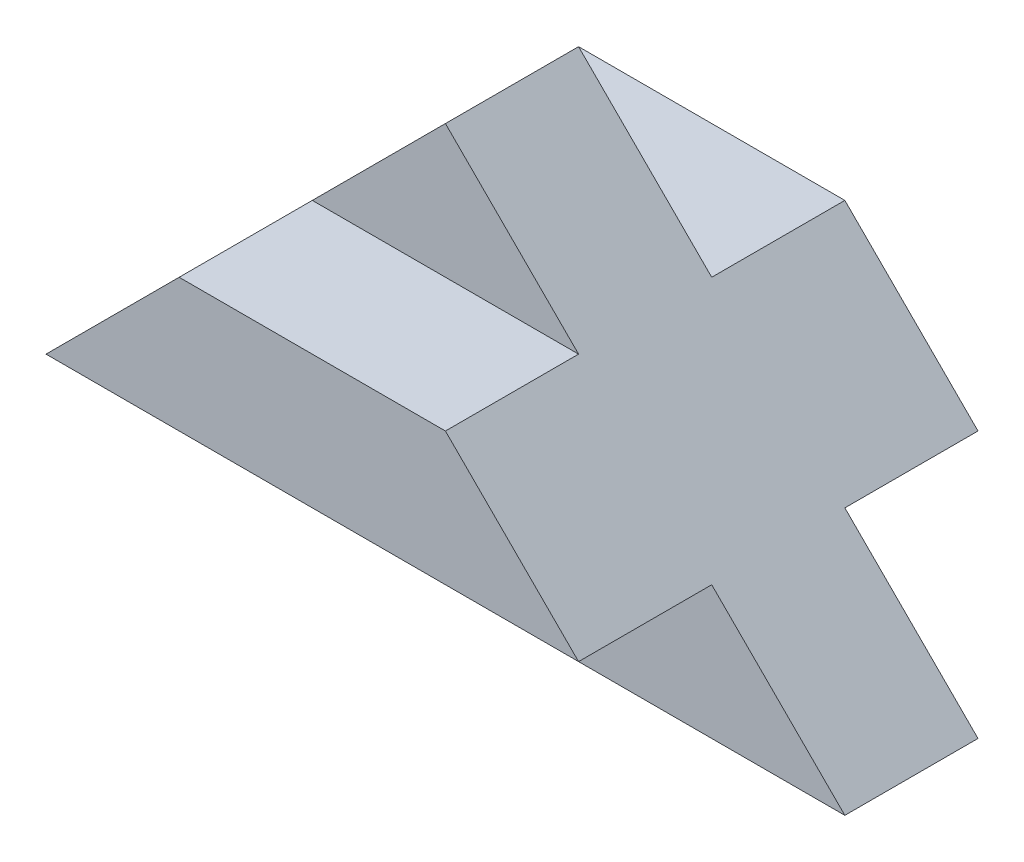
ISO-10303-21;
HEADER;
FILE_DESCRIPTION(('STEP AP214'),'2;1');
FILE_NAME('part.step','',(''),(''),'','','');
FILE_SCHEMA(('AUTOMOTIVE_DESIGN { 1 0 10303 214 1 1 1 1 }'));
ENDSEC;
DATA;
#1=APPLICATION_CONTEXT('core data for automotive mechanical design processes');
#2=APPLICATION_PROTOCOL_DEFINITION('international standard','automotive_design',2000,#1);
#3=PRODUCT_CONTEXT('',#1,'mechanical');
#4=PRODUCT('Part','Part','',(#3));
#5=PRODUCT_RELATED_PRODUCT_CATEGORY('part','',(#4));
#6=PRODUCT_DEFINITION_FORMATION('','',#4);
#7=PRODUCT_DEFINITION_CONTEXT('part definition',#1,'design');
#8=PRODUCT_DEFINITION('design','',#6,#7);
#9=PRODUCT_DEFINITION_SHAPE('','',#8);
#10=(LENGTH_UNIT() NAMED_UNIT(*) SI_UNIT(.MILLI.,.METRE.));
#11=(NAMED_UNIT(*) PLANE_ANGLE_UNIT() SI_UNIT($,.RADIAN.));
#12=(NAMED_UNIT(*) SI_UNIT($,.STERADIAN.) SOLID_ANGLE_UNIT());
#13=UNCERTAINTY_MEASURE_WITH_UNIT(LENGTH_MEASURE(1.E-05),#10,'distance_accuracy_value','');
#14=(GEOMETRIC_REPRESENTATION_CONTEXT(3) GLOBAL_UNCERTAINTY_ASSIGNED_CONTEXT((#13)) GLOBAL_UNIT_ASSIGNED_CONTEXT((#10,
#11,#12)) REPRESENTATION_CONTEXT('',''));
#15=CARTESIAN_POINT('',(0.,0.,0.));
#16=DIRECTION('',(0.,0.,1.));
#17=DIRECTION('',(1.,0.,0.));
#18=AXIS2_PLACEMENT_3D('',#15,#16,#17);
#19=CARTESIAN_POINT('',(304.8,50.8,76.2));
#20=DIRECTION('',(0.,1.,0.));
#21=DIRECTION('',(0.,0.,1.));
#22=AXIS2_PLACEMENT_3D('',#19,#20,#21);
#23=PLANE('',#22);
#24=DIRECTION('',(-1.,0.,0.));
#25=VECTOR('',#24,1.);
#26=CARTESIAN_POINT('',(304.8,50.8,-76.2));
#27=LINE('',#26,#25);
#28=CARTESIAN_POINT('',(254.,50.8,-76.2));
#29=VERTEX_POINT('',#28);
#30=CARTESIAN_POINT('',(50.8000000000002,50.8,-76.2));
#31=VERTEX_POINT('',#30);
#32=EDGE_CURVE('E168',#29,#31,#27,.T.);
#33=ORIENTED_EDGE('',*,*,#32,.F.);
#34=DIRECTION('',(0.,0.,1.));
#35=VECTOR('',#34,1.);
#36=CARTESIAN_POINT('',(254.,50.8,25.4));
#37=LINE('',#36,#35);
#38=CARTESIAN_POINT('',(254.,50.8,-25.4));
#39=VERTEX_POINT('',#38);
#40=EDGE_CURVE('E195',#29,#39,#37,.T.);
#41=ORIENTED_EDGE('',*,*,#40,.T.);
#42=DIRECTION('',(-1.,0.,0.));
#43=VECTOR('',#42,1.);
#44=CARTESIAN_POINT('',(304.8,50.8,-25.4));
#45=LINE('',#44,#43);
#46=CARTESIAN_POINT('',(50.8000000000001,50.8,-25.4));
#47=VERTEX_POINT('',#46);
#48=EDGE_CURVE('E175',#39,#47,#45,.T.);
#49=ORIENTED_EDGE('',*,*,#48,.T.);
#50=DIRECTION('',(0.,0.,1.));
#51=VECTOR('',#50,1.);
#52=CARTESIAN_POINT('',(50.8000000000001,50.8,0.));
#53=LINE('',#52,#51);
#54=EDGE_CURVE('E193',#47,#31,#53,.F.);
#55=ORIENTED_EDGE('',*,*,#54,.T.);
#56=EDGE_LOOP('',(#33,#41,#49,#55));
#57=FACE_BOUND('',#56,.T.);
#58=ADVANCED_FACE('F57',(#57),#23,.F.);
#59=CARTESIAN_POINT('',(304.8,101.6,-76.2));
#60=DIRECTION('',(0.,0.,-1.));
#61=DIRECTION('',(-1.,0.,0.));
#62=AXIS2_PLACEMENT_3D('',#59,#60,#61);
#63=PLANE('',#62);
#64=DIRECTION('',(-1.,0.,0.));
#65=VECTOR('',#64,1.);
#66=CARTESIAN_POINT('',(304.8,101.6,-76.2));
#67=LINE('',#66,#65);
#68=CARTESIAN_POINT('',(203.2,101.6,-76.2));
#69=VERTEX_POINT('',#68);
#70=CARTESIAN_POINT('',(101.6,101.6,-76.2));
#71=VERTEX_POINT('',#70);
#72=EDGE_CURVE('E233',#69,#71,#67,.T.);
#73=ORIENTED_EDGE('',*,*,#72,.F.);
#74=DIRECTION('',(0.707106781186546,-0.707106781186549,0.));
#75=VECTOR('',#74,1.);
#76=CARTESIAN_POINT('',(254.,50.7999999999999,-76.2));
#77=LINE('',#76,#75);
#78=EDGE_CURVE('E191',#69,#29,#77,.T.);
#79=ORIENTED_EDGE('',*,*,#78,.T.);
#80=ORIENTED_EDGE('',*,*,#32,.T.);
#81=DIRECTION('',(-0.707106781186549,-0.707106781186546,0.));
#82=VECTOR('',#81,1.);
#83=CARTESIAN_POINT('',(203.200000000001,203.2,-76.2));
#84=LINE('',#83,#82);
#85=EDGE_CURVE('E189',#31,#71,#84,.F.);
#86=ORIENTED_EDGE('',*,*,#85,.T.);
#87=EDGE_LOOP('',(#73,#79,#80,#86));
#88=FACE_BOUND('',#87,.T.);
#89=ADVANCED_FACE('F252',(#88),#63,.T.);
#90=CARTESIAN_POINT('',(304.8,101.6,76.2));
#91=DIRECTION('',(0.,1.,0.));
#92=DIRECTION('',(0.,0.,1.));
#93=AXIS2_PLACEMENT_3D('',#90,#91,#92);
#94=PLANE('',#93);
#95=DIRECTION('',(-1.,0.,0.));
#96=VECTOR('',#95,1.);
#97=CARTESIAN_POINT('',(304.8,101.6,-25.4));
#98=LINE('',#97,#96);
#99=CARTESIAN_POINT('',(203.2,101.6,-25.4));
#100=VERTEX_POINT('',#99);
#101=CARTESIAN_POINT('',(101.6,101.6,-25.4));
#102=VERTEX_POINT('',#101);
#103=EDGE_CURVE('E171',#100,#102,#98,.T.);
#104=ORIENTED_EDGE('',*,*,#103,.F.);
#105=DIRECTION('',(0.,0.,-1.));
#106=VECTOR('',#105,1.);
#107=CARTESIAN_POINT('',(203.2,101.6,76.2));
#108=LINE('',#107,#106);
#109=EDGE_CURVE('E187',#100,#69,#108,.T.);
#110=ORIENTED_EDGE('',*,*,#109,.T.);
#111=ORIENTED_EDGE('',*,*,#72,.T.);
#112=DIRECTION('',(0.,0.,-1.));
#113=VECTOR('',#112,1.);
#114=CARTESIAN_POINT('',(101.6,101.6,76.2));
#115=LINE('',#114,#113);
#116=EDGE_CURVE('E185',#71,#102,#115,.F.);
#117=ORIENTED_EDGE('',*,*,#116,.T.);
#118=EDGE_LOOP('',(#104,#110,#111,#117));
#119=FACE_BOUND('',#118,.T.);
#120=ADVANCED_FACE('F255',(#119),#94,.T.);
#121=CARTESIAN_POINT('',(304.8,50.8,76.2));
#122=DIRECTION('',(0.,0.,1.));
#123=DIRECTION('',(1.,0.,0.));
#124=AXIS2_PLACEMENT_3D('',#121,#122,#123);
#125=PLANE('',#124);
#126=DIRECTION('',(-1.,0.,0.));
#127=VECTOR('',#126,1.);
#128=CARTESIAN_POINT('',(304.8,50.8,76.2));
#129=LINE('',#128,#127);
#130=CARTESIAN_POINT('',(254.,50.8,76.2));
#131=VERTEX_POINT('',#130);
#132=CARTESIAN_POINT('',(50.8000000000002,50.8,76.2));
#133=VERTEX_POINT('',#132);
#134=EDGE_CURVE('E158',#131,#133,#129,.T.);
#135=ORIENTED_EDGE('',*,*,#134,.F.);
#136=DIRECTION('',(-0.707106781186546,0.707106781186549,0.));
#137=VECTOR('',#136,1.);
#138=CARTESIAN_POINT('',(279.4,25.3999999999998,76.2));
#139=LINE('',#138,#137);
#140=CARTESIAN_POINT('',(203.2,101.6,76.2));
#141=VERTEX_POINT('',#140);
#142=EDGE_CURVE('E206',#131,#141,#139,.T.);
#143=ORIENTED_EDGE('',*,*,#142,.T.);
#144=DIRECTION('',(-1.,0.,0.));
#145=VECTOR('',#144,1.);
#146=CARTESIAN_POINT('',(304.8,101.6,76.2));
#147=LINE('',#146,#145);
#148=CARTESIAN_POINT('',(101.6,101.6,76.2));
#149=VERTEX_POINT('',#148);
#150=EDGE_CURVE('E218',#141,#149,#147,.T.);
#151=ORIENTED_EDGE('',*,*,#150,.T.);
#152=DIRECTION('',(0.707106781186549,0.707106781186546,0.));
#153=VECTOR('',#152,1.);
#154=CARTESIAN_POINT('',(177.800000000001,177.8,76.2));
#155=LINE('',#154,#153);
#156=EDGE_CURVE('E204',#149,#133,#155,.F.);
#157=ORIENTED_EDGE('',*,*,#156,.T.);
#158=EDGE_LOOP('',(#135,#143,#151,#157));
#159=FACE_BOUND('',#158,.T.);
#160=ADVANCED_FACE('F231',(#159),#125,.T.);
#161=DIRECTION('',(-1.,0.,0.));
#162=VECTOR('',#161,1.);
#163=CARTESIAN_POINT('',(304.8,50.8,25.4));
#164=LINE('',#163,#162);
#165=CARTESIAN_POINT('',(254.,50.8,25.4));
#166=VERTEX_POINT('',#165);
#167=CARTESIAN_POINT('',(50.8000000000001,50.8,25.4));
#168=VERTEX_POINT('',#167);
#169=EDGE_CURVE('E178',#166,#168,#164,.T.);
#170=ORIENTED_EDGE('',*,*,#169,.F.);
#171=DIRECTION('',(0.,0.,1.));
#172=VECTOR('',#171,1.);
#173=CARTESIAN_POINT('',(254.,50.8,25.4));
#174=LINE('',#173,#172);
#175=EDGE_CURVE('E144',#166,#131,#174,.T.);
#176=ORIENTED_EDGE('',*,*,#175,.T.);
#177=ORIENTED_EDGE('',*,*,#134,.T.);
#178=DIRECTION('',(0.,0.,1.));
#179=VECTOR('',#178,1.);
#180=CARTESIAN_POINT('',(50.8000000000001,50.8,0.));
#181=LINE('',#180,#179);
#182=EDGE_CURVE('E148',#133,#168,#181,.F.);
#183=ORIENTED_EDGE('',*,*,#182,.T.);
#184=EDGE_LOOP('',(#170,#176,#177,#183));
#185=FACE_BOUND('',#184,.T.);
#186=ADVANCED_FACE('F238',(#185),#23,.F.);
#187=ORIENTED_EDGE('',*,*,#150,.F.);
#188=DIRECTION('',(0.,0.,-1.));
#189=VECTOR('',#188,1.);
#190=CARTESIAN_POINT('',(203.2,101.6,76.2));
#191=LINE('',#190,#189);
#192=CARTESIAN_POINT('',(203.2,101.6,25.4));
#193=VERTEX_POINT('',#192);
#194=EDGE_CURVE('E210',#141,#193,#191,.T.);
#195=ORIENTED_EDGE('',*,*,#194,.T.);
#196=DIRECTION('',(-1.,0.,0.));
#197=VECTOR('',#196,1.);
#198=CARTESIAN_POINT('',(304.8,101.6,25.4));
#199=LINE('',#198,#197);
#200=CARTESIAN_POINT('',(101.6,101.6,25.4));
#201=VERTEX_POINT('',#200);
#202=EDGE_CURVE('E174',#193,#201,#199,.T.);
#203=ORIENTED_EDGE('',*,*,#202,.T.);
#204=DIRECTION('',(0.,0.,-1.));
#205=VECTOR('',#204,1.);
#206=CARTESIAN_POINT('',(101.6,101.6,76.2));
#207=LINE('',#206,#205);
#208=EDGE_CURVE('E208',#201,#149,#207,.F.);
#209=ORIENTED_EDGE('',*,*,#208,.T.);
#210=EDGE_LOOP('',(#187,#195,#203,#209));
#211=FACE_BOUND('',#210,.T.);
#212=ADVANCED_FACE('F215',(#211),#94,.T.);
#213=CARTESIAN_POINT('',(304.8,152.4,25.4));
#214=DIRECTION('',(0.,0.,-1.));
#215=DIRECTION('',(0.,1.,0.));
#216=AXIS2_PLACEMENT_3D('',#213,#214,#215);
#217=PLANE('',#216);
#218=ORIENTED_EDGE('',*,*,#202,.F.);
#219=DIRECTION('',(-0.707106781186546,0.707106781186549,0.));
#220=VECTOR('',#219,1.);
#221=CARTESIAN_POINT('',(152.4,152.4,25.4));
#222=LINE('',#221,#220);
#223=CARTESIAN_POINT('',(152.400000000001,152.4,25.4));
#224=VERTEX_POINT('',#223);
#225=EDGE_CURVE('E12',#193,#224,#222,.T.);
#226=ORIENTED_EDGE('',*,*,#225,.T.);
#227=DIRECTION('',(0.707106781186549,0.707106781186546,0.));
#228=VECTOR('',#227,1.);
#229=CARTESIAN_POINT('',(0.,1.12059170085794E-13,25.4));
#230=LINE('',#229,#228);
#231=EDGE_CURVE('E66',#224,#201,#230,.F.);
#232=ORIENTED_EDGE('',*,*,#231,.T.);
#233=EDGE_LOOP('',(#218,#226,#232));
#234=FACE_BOUND('',#233,.T.);
#235=ADVANCED_FACE('F219',(#234),#217,.F.);
#236=CARTESIAN_POINT('',(304.8,152.4,-25.4));
#237=DIRECTION('',(0.,0.,-1.));
#238=DIRECTION('',(0.,1.,0.));
#239=AXIS2_PLACEMENT_3D('',#236,#237,#238);
#240=PLANE('',#239);
#241=DIRECTION('',(-0.707106781186549,-0.707106781186546,0.));
#242=VECTOR('',#241,1.);
#243=CARTESIAN_POINT('',(228.600000000001,228.6,-25.4));
#244=LINE('',#243,#242);
#245=CARTESIAN_POINT('',(152.400000000001,152.4,-25.4));
#246=VERTEX_POINT('',#245);
#247=EDGE_CURVE('E181',#102,#246,#244,.F.);
#248=ORIENTED_EDGE('',*,*,#247,.T.);
#249=DIRECTION('',(0.707106781186546,-0.707106781186549,0.));
#250=VECTOR('',#249,1.);
#251=CARTESIAN_POINT('',(228.6,76.2,-25.4));
#252=LINE('',#251,#250);
#253=EDGE_CURVE('E183',#246,#100,#252,.T.);
#254=ORIENTED_EDGE('',*,*,#253,.T.);
#255=ORIENTED_EDGE('',*,*,#103,.T.);
#256=EDGE_LOOP('',(#248,#254,#255));
#257=FACE_BOUND('',#256,.T.);
#258=ADVANCED_FACE('F257',(#257),#240,.T.);
#259=DIRECTION('',(-1.,0.,0.));
#260=VECTOR('',#259,1.);
#261=CARTESIAN_POINT('',(304.8,0.,25.4));
#262=LINE('',#261,#260);
#263=CARTESIAN_POINT('',(304.8,0.,25.4));
#264=VERTEX_POINT('',#263);
#265=CARTESIAN_POINT('',(0.,0.,25.4));
#266=VERTEX_POINT('',#265);
#267=EDGE_CURVE('E152',#264,#266,#262,.T.);
#268=ORIENTED_EDGE('',*,*,#267,.F.);
#269=DIRECTION('',(-0.707106781186546,0.707106781186549,0.));
#270=VECTOR('',#269,1.);
#271=CARTESIAN_POINT('',(152.4,152.4,25.4));
#272=LINE('',#271,#270);
#273=EDGE_CURVE('E137',#264,#166,#272,.T.);
#274=ORIENTED_EDGE('',*,*,#273,.T.);
#275=ORIENTED_EDGE('',*,*,#169,.T.);
#276=DIRECTION('',(0.707106781186549,0.707106781186546,0.));
#277=VECTOR('',#276,1.);
#278=CARTESIAN_POINT('',(0.,1.12059170085794E-13,25.4));
#279=LINE('',#278,#277);
#280=EDGE_CURVE('E149',#168,#266,#279,.F.);
#281=ORIENTED_EDGE('',*,*,#280,.T.);
#282=EDGE_LOOP('',(#268,#274,#275,#281));
#283=FACE_BOUND('',#282,.T.);
#284=ADVANCED_FACE('F153',(#283),#217,.F.);
#285=CARTESIAN_POINT('',(304.8,0.,-25.4));
#286=DIRECTION('',(0.,-1.,0.));
#287=DIRECTION('',(0.,0.,-1.));
#288=AXIS2_PLACEMENT_3D('',#285,#286,#287);
#289=PLANE('',#288);
#290=DIRECTION('',(0.,0.,1.));
#291=VECTOR('',#290,1.);
#292=CARTESIAN_POINT('',(0.,0.,-25.4));
#293=LINE('',#292,#291);
#294=CARTESIAN_POINT('',(0.,0.,-25.4));
#295=VERTEX_POINT('',#294);
#296=EDGE_CURVE('E163',#295,#266,#293,.T.);
#297=ORIENTED_EDGE('',*,*,#296,.F.);
#298=DIRECTION('',(-1.,0.,0.));
#299=VECTOR('',#298,1.);
#300=CARTESIAN_POINT('',(304.8,0.,-25.4));
#301=LINE('',#300,#299);
#302=CARTESIAN_POINT('',(304.8,0.,-25.4));
#303=VERTEX_POINT('',#302);
#304=EDGE_CURVE('E159',#303,#295,#301,.T.);
#305=ORIENTED_EDGE('',*,*,#304,.F.);
#306=DIRECTION('',(0.,0.,1.));
#307=VECTOR('',#306,1.);
#308=CARTESIAN_POINT('',(304.8,0.,-25.4));
#309=LINE('',#308,#307);
#310=EDGE_CURVE('E142',#303,#264,#309,.T.);
#311=ORIENTED_EDGE('',*,*,#310,.T.);
#312=ORIENTED_EDGE('',*,*,#267,.T.);
#313=EDGE_LOOP('',(#297,#305,#311,#312));
#314=FACE_BOUND('',#313,.T.);
#315=ADVANCED_FACE('F162',(#314),#289,.T.);
#316=ORIENTED_EDGE('',*,*,#48,.F.);
#317=DIRECTION('',(0.707106781186546,-0.707106781186549,0.));
#318=VECTOR('',#317,1.);
#319=CARTESIAN_POINT('',(228.6,76.2,-25.4));
#320=LINE('',#319,#318);
#321=EDGE_CURVE('E199',#39,#303,#320,.T.);
#322=ORIENTED_EDGE('',*,*,#321,.T.);
#323=ORIENTED_EDGE('',*,*,#304,.T.);
#324=DIRECTION('',(-0.707106781186549,-0.707106781186546,0.));
#325=VECTOR('',#324,1.);
#326=CARTESIAN_POINT('',(228.600000000001,228.6,-25.4));
#327=LINE('',#326,#325);
#328=EDGE_CURVE('E197',#295,#47,#327,.F.);
#329=ORIENTED_EDGE('',*,*,#328,.T.);
#330=EDGE_LOOP('',(#316,#322,#323,#329));
#331=FACE_BOUND('',#330,.T.);
#332=ADVANCED_FACE('F244',(#331),#240,.T.);
#333=CARTESIAN_POINT('',(0.,1.11022302462516E-13,0.));
#334=DIRECTION('',(0.707106781186546,-0.707106781186549,0.));
#335=DIRECTION('',(0.,0.,-1.));
#336=AXIS2_PLACEMENT_3D('',#333,#334,#335);
#337=PLANE('',#336);
#338=ORIENTED_EDGE('',*,*,#208,.F.);
#339=ORIENTED_EDGE('',*,*,#231,.F.);
#340=DIRECTION('',(0.,0.,1.));
#341=VECTOR('',#340,1.);
#342=CARTESIAN_POINT('',(152.400000000001,152.4,25.4));
#343=LINE('',#342,#341);
#344=EDGE_CURVE('E61',#246,#224,#343,.T.);
#345=ORIENTED_EDGE('',*,*,#344,.F.);
#346=ORIENTED_EDGE('',*,*,#247,.F.);
#347=ORIENTED_EDGE('',*,*,#116,.F.);
#348=ORIENTED_EDGE('',*,*,#85,.F.);
#349=ORIENTED_EDGE('',*,*,#54,.F.);
#350=ORIENTED_EDGE('',*,*,#328,.F.);
#351=ORIENTED_EDGE('',*,*,#296,.T.);
#352=ORIENTED_EDGE('',*,*,#280,.F.);
#353=ORIENTED_EDGE('',*,*,#182,.F.);
#354=ORIENTED_EDGE('',*,*,#156,.F.);
#355=EDGE_LOOP('',(#338,#339,#345,#346,#347,#348,#349,#350,#351,#352,#353,#354));
#356=FACE_BOUND('',#355,.T.);
#357=ADVANCED_FACE('F59',(#356),#337,.F.);
#358=CARTESIAN_POINT('',(152.4,152.4,25.4));
#359=DIRECTION('',(0.707106781186549,0.707106781186546,0.));
#360=DIRECTION('',(0.,0.,1.));
#361=AXIS2_PLACEMENT_3D('',#358,#359,#360);
#362=PLANE('',#361);
#363=ORIENTED_EDGE('',*,*,#273,.F.);
#364=ORIENTED_EDGE('',*,*,#310,.F.);
#365=ORIENTED_EDGE('',*,*,#321,.F.);
#366=ORIENTED_EDGE('',*,*,#40,.F.);
#367=ORIENTED_EDGE('',*,*,#78,.F.);
#368=ORIENTED_EDGE('',*,*,#109,.F.);
#369=ORIENTED_EDGE('',*,*,#253,.F.);
#370=ORIENTED_EDGE('',*,*,#344,.T.);
#371=ORIENTED_EDGE('',*,*,#225,.F.);
#372=ORIENTED_EDGE('',*,*,#194,.F.);
#373=ORIENTED_EDGE('',*,*,#142,.F.);
#374=ORIENTED_EDGE('',*,*,#175,.F.);
#375=EDGE_LOOP('',(#363,#364,#365,#366,#367,#368,#369,#370,#371,#372,#373,#374));
#376=FACE_BOUND('',#375,.T.);
#377=ADVANCED_FACE('F139',(#376),#362,.T.);
#378=CLOSED_SHELL('',(#58,#89,#120,#160,#186,#212,#235,#258,#284,#315,#332,#357,#377));
#379=MANIFOLD_SOLID_BREP('B2',#378);
#380=ADVANCED_BREP_SHAPE_REPRESENTATION('',(#18,#379),#14);
#381=SHAPE_DEFINITION_REPRESENTATION(#9,#380);
ENDSEC;
END-ISO-10303-21;
